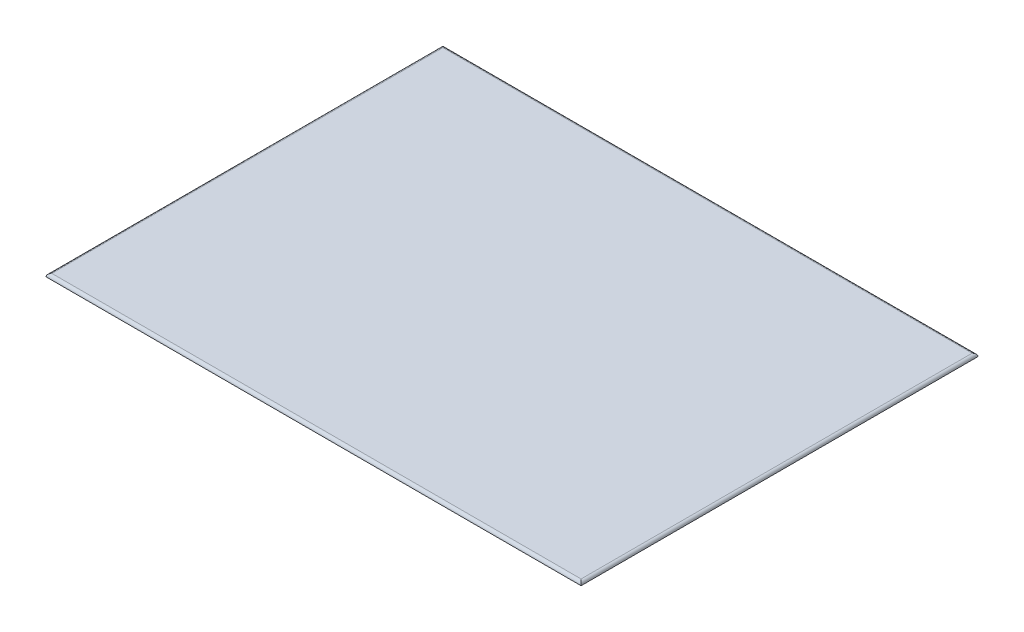
ISO-10303-21;
HEADER;
FILE_DESCRIPTION(('STEP AP214'),'2;1');
FILE_NAME('part.step','',(''),(''),'','','');
FILE_SCHEMA(('AUTOMOTIVE_DESIGN { 1 0 10303 214 1 1 1 1 }'));
ENDSEC;
DATA;
#1=APPLICATION_CONTEXT('core data for automotive mechanical design processes');
#2=APPLICATION_PROTOCOL_DEFINITION('international standard','automotive_design',2000,#1);
#3=PRODUCT_CONTEXT('',#1,'mechanical');
#4=PRODUCT('Part','Part','',(#3));
#5=PRODUCT_RELATED_PRODUCT_CATEGORY('part','',(#4));
#6=PRODUCT_DEFINITION_FORMATION('','',#4);
#7=PRODUCT_DEFINITION_CONTEXT('part definition',#1,'design');
#8=PRODUCT_DEFINITION('design','',#6,#7);
#9=PRODUCT_DEFINITION_SHAPE('','',#8);
#10=(LENGTH_UNIT() NAMED_UNIT(*) SI_UNIT(.MILLI.,.METRE.));
#11=(NAMED_UNIT(*) PLANE_ANGLE_UNIT() SI_UNIT($,.RADIAN.));
#12=(NAMED_UNIT(*) SI_UNIT($,.STERADIAN.) SOLID_ANGLE_UNIT());
#13=UNCERTAINTY_MEASURE_WITH_UNIT(LENGTH_MEASURE(1.E-05),#10,'distance_accuracy_value','');
#14=(GEOMETRIC_REPRESENTATION_CONTEXT(3) GLOBAL_UNCERTAINTY_ASSIGNED_CONTEXT((#13)) GLOBAL_UNIT_ASSIGNED_CONTEXT((#10,
#11,#12)) REPRESENTATION_CONTEXT('',''));
#15=CARTESIAN_POINT('',(0.,0.,0.));
#16=DIRECTION('',(0.,0.,1.));
#17=DIRECTION('',(1.,0.,0.));
#18=AXIS2_PLACEMENT_3D('',#15,#16,#17);
#19=CARTESIAN_POINT('',(0.,9.,0.));
#20=DIRECTION('',(0.,-1.,0.));
#21=DIRECTION('',(0.,0.,-1.));
#22=AXIS2_PLACEMENT_3D('',#19,#20,#21);
#23=PLANE('',#22);
#24=DIRECTION('',(0.,0.,1.));
#25=VECTOR('',#24,1.);
#26=CARTESIAN_POINT('',(-90.,9.,0.));
#27=LINE('',#26,#25);
#28=CARTESIAN_POINT('',(-90.,9.,-66.5));
#29=VERTEX_POINT('',#28);
#30=CARTESIAN_POINT('',(-90.,9.,66.5));
#31=VERTEX_POINT('',#30);
#32=EDGE_CURVE('E117',#29,#31,#27,.T.);
#33=ORIENTED_EDGE('',*,*,#32,.T.);
#34=DIRECTION('',(1.,0.,0.));
#35=VECTOR('',#34,1.);
#36=CARTESIAN_POINT('',(0.,9.,66.5));
#37=LINE('',#36,#35);
#38=CARTESIAN_POINT('',(90.,9.,66.5));
#39=VERTEX_POINT('',#38);
#40=EDGE_CURVE('E97',#31,#39,#37,.T.);
#41=ORIENTED_EDGE('',*,*,#40,.T.);
#42=DIRECTION('',(0.,0.,-1.));
#43=VECTOR('',#42,1.);
#44=CARTESIAN_POINT('',(90.,9.,0.));
#45=LINE('',#44,#43);
#46=CARTESIAN_POINT('',(90.,9.,-66.5));
#47=VERTEX_POINT('',#46);
#48=EDGE_CURVE('E107',#39,#47,#45,.T.);
#49=ORIENTED_EDGE('',*,*,#48,.T.);
#50=DIRECTION('',(-1.,0.,0.));
#51=VECTOR('',#50,1.);
#52=CARTESIAN_POINT('',(0.,9.,-66.5));
#53=LINE('',#52,#51);
#54=EDGE_CURVE('E113',#47,#29,#53,.T.);
#55=ORIENTED_EDGE('',*,*,#54,.T.);
#56=EDGE_LOOP('',(#33,#41,#49,#55));
#57=FACE_BOUND('',#56,.T.);
#58=ADVANCED_FACE('F39',(#57),#23,.F.);
#59=CARTESIAN_POINT('',(0.,0.,0.));
#60=DIRECTION('',(0.,-1.,0.));
#61=DIRECTION('',(0.,0.,-1.));
#62=AXIS2_PLACEMENT_3D('',#59,#60,#61);
#63=PLANE('',#62);
#64=DIRECTION('',(0.,0.,-1.));
#65=VECTOR('',#64,1.);
#66=CARTESIAN_POINT('',(-62.4342862858286,0.,-67.5));
#67=LINE('',#66,#65);
#68=CARTESIAN_POINT('',(-62.4342862858286,0.,38.9342862858286));
#69=VERTEX_POINT('',#68);
#70=CARTESIAN_POINT('',(-62.4342862858286,0.,-38.9342862858286));
#71=VERTEX_POINT('',#70);
#72=EDGE_CURVE('E49',#69,#71,#67,.T.);
#73=ORIENTED_EDGE('',*,*,#72,.T.);
#74=DIRECTION('',(1.,0.,0.));
#75=VECTOR('',#74,1.);
#76=CARTESIAN_POINT('',(91.,0.,-38.9342862858286));
#77=LINE('',#76,#75);
#78=CARTESIAN_POINT('',(62.4342862858286,0.,-38.9342862858286));
#79=VERTEX_POINT('',#78);
#80=EDGE_CURVE('E11',#71,#79,#77,.T.);
#81=ORIENTED_EDGE('',*,*,#80,.T.);
#82=DIRECTION('',(0.,0.,1.));
#83=VECTOR('',#82,1.);
#84=CARTESIAN_POINT('',(62.4342862858286,0.,67.5));
#85=LINE('',#84,#83);
#86=CARTESIAN_POINT('',(62.4342862858286,0.,38.9342862858286));
#87=VERTEX_POINT('',#86);
#88=EDGE_CURVE('E138',#79,#87,#85,.T.);
#89=ORIENTED_EDGE('',*,*,#88,.T.);
#90=DIRECTION('',(-1.,0.,0.));
#91=VECTOR('',#90,1.);
#92=CARTESIAN_POINT('',(-91.,0.,38.9342862858286));
#93=LINE('',#92,#91);
#94=EDGE_CURVE('E60',#87,#69,#93,.T.);
#95=ORIENTED_EDGE('',*,*,#94,.T.);
#96=EDGE_LOOP('',(#73,#81,#89,#95));
#97=FACE_BOUND('',#96,.T.);
#98=ADVANCED_FACE('F175',(#97),#63,.T.);
#99=CARTESIAN_POINT('',(0.,8.,-66.5));
#100=DIRECTION('',(-1.,0.,0.));
#101=DIRECTION('',(0.,0.,1.));
#102=AXIS2_PLACEMENT_3D('',#99,#100,#101);
#103=CYLINDRICAL_SURFACE('',#102,1.);
#104=CARTESIAN_POINT('',(90.,8.,-66.5));
#105=DIRECTION('',(-0.707106781186547,0.,-0.707106781186547));
#106=DIRECTION('',(0.707106781186547,0.,-0.707106781186547));
#107=AXIS2_PLACEMENT_3D('',#104,#105,#106);
#108=ELLIPSE('',#107,1.41421356237309,1.);
#109=CARTESIAN_POINT('',(91.,8.,-67.5));
#110=VERTEX_POINT('',#109);
#111=EDGE_CURVE('E109',#110,#47,#108,.F.);
#112=ORIENTED_EDGE('',*,*,#111,.F.);
#113=DIRECTION('',(-1.,0.,0.));
#114=VECTOR('',#113,1.);
#115=CARTESIAN_POINT('',(-91.,8.,-67.5));
#116=LINE('',#115,#114);
#117=CARTESIAN_POINT('',(-91.,8.,-67.5));
#118=VERTEX_POINT('',#117);
#119=EDGE_CURVE('E131',#118,#110,#116,.F.);
#120=ORIENTED_EDGE('',*,*,#119,.F.);
#121=CARTESIAN_POINT('',(-90.,8.,-66.5));
#122=DIRECTION('',(-0.707106781186547,0.,0.707106781186547));
#123=DIRECTION('',(-0.707106781186547,0.,-0.707106781186547));
#124=AXIS2_PLACEMENT_3D('',#121,#122,#123);
#125=ELLIPSE('',#124,1.41421356237309,1.);
#126=EDGE_CURVE('E114',#29,#118,#125,.T.);
#127=ORIENTED_EDGE('',*,*,#126,.F.);
#128=ORIENTED_EDGE('',*,*,#54,.F.);
#129=EDGE_LOOP('',(#112,#120,#127,#128));
#130=FACE_BOUND('',#129,.T.);
#131=ADVANCED_FACE('F177',(#130),#103,.T.);
#132=CARTESIAN_POINT('',(-90.,8.,0.));
#133=DIRECTION('',(0.,0.,1.));
#134=DIRECTION('',(1.,0.,0.));
#135=AXIS2_PLACEMENT_3D('',#132,#133,#134);
#136=CYLINDRICAL_SURFACE('',#135,1.);
#137=ORIENTED_EDGE('',*,*,#126,.T.);
#138=DIRECTION('',(0.,0.,1.));
#139=VECTOR('',#138,1.);
#140=CARTESIAN_POINT('',(-91.,8.,67.5));
#141=LINE('',#140,#139);
#142=CARTESIAN_POINT('',(-91.,8.,67.5));
#143=VERTEX_POINT('',#142);
#144=EDGE_CURVE('E123',#143,#118,#141,.F.);
#145=ORIENTED_EDGE('',*,*,#144,.F.);
#146=CARTESIAN_POINT('',(-90.,8.,66.5));
#147=DIRECTION('',(0.707106781186547,0.,0.707106781186547));
#148=DIRECTION('',(-0.707106781186547,0.,0.707106781186547));
#149=AXIS2_PLACEMENT_3D('',#146,#147,#148);
#150=ELLIPSE('',#149,1.41421356237309,1.);
#151=EDGE_CURVE('E104',#31,#143,#150,.T.);
#152=ORIENTED_EDGE('',*,*,#151,.F.);
#153=ORIENTED_EDGE('',*,*,#32,.F.);
#154=EDGE_LOOP('',(#137,#145,#152,#153));
#155=FACE_BOUND('',#154,.T.);
#156=ADVANCED_FACE('F183',(#155),#136,.T.);
#157=CARTESIAN_POINT('',(90.,8.,0.));
#158=DIRECTION('',(0.,0.,-1.));
#159=DIRECTION('',(-1.,0.,0.));
#160=AXIS2_PLACEMENT_3D('',#157,#158,#159);
#161=CYLINDRICAL_SURFACE('',#160,1.);
#162=ORIENTED_EDGE('',*,*,#111,.T.);
#163=ORIENTED_EDGE('',*,*,#48,.F.);
#164=CARTESIAN_POINT('',(90.,8.,66.5));
#165=DIRECTION('',(0.707106781186547,0.,-0.707106781186547));
#166=DIRECTION('',(-0.707106781186547,0.,-0.707106781186547));
#167=AXIS2_PLACEMENT_3D('',#164,#165,#166);
#168=ELLIPSE('',#167,1.41421356237309,1.);
#169=CARTESIAN_POINT('',(91.,8.,67.5));
#170=VERTEX_POINT('',#169);
#171=EDGE_CURVE('E93',#170,#39,#168,.F.);
#172=ORIENTED_EDGE('',*,*,#171,.F.);
#173=DIRECTION('',(0.,0.,-1.));
#174=VECTOR('',#173,1.);
#175=CARTESIAN_POINT('',(91.,8.,67.5));
#176=LINE('',#175,#174);
#177=EDGE_CURVE('E135',#110,#170,#176,.F.);
#178=ORIENTED_EDGE('',*,*,#177,.F.);
#179=EDGE_LOOP('',(#162,#163,#172,#178));
#180=FACE_BOUND('',#179,.T.);
#181=ADVANCED_FACE('F108',(#180),#161,.T.);
#182=CARTESIAN_POINT('',(0.,8.,66.5));
#183=DIRECTION('',(1.,0.,0.));
#184=DIRECTION('',(0.,0.,-1.));
#185=AXIS2_PLACEMENT_3D('',#182,#183,#184);
#186=CYLINDRICAL_SURFACE('',#185,1.);
#187=ORIENTED_EDGE('',*,*,#151,.T.);
#188=DIRECTION('',(1.,0.,0.));
#189=VECTOR('',#188,1.);
#190=CARTESIAN_POINT('',(-91.,8.,67.5));
#191=LINE('',#190,#189);
#192=EDGE_CURVE('E99',#170,#143,#191,.F.);
#193=ORIENTED_EDGE('',*,*,#192,.F.);
#194=ORIENTED_EDGE('',*,*,#171,.T.);
#195=ORIENTED_EDGE('',*,*,#40,.F.);
#196=EDGE_LOOP('',(#187,#193,#194,#195));
#197=FACE_BOUND('',#196,.T.);
#198=ADVANCED_FACE('F95',(#197),#186,.T.);
#199=CARTESIAN_POINT('',(-91.,55.,38.9342862858286));
#200=DIRECTION('',(1.,0.,0.));
#201=DIRECTION('',(0.,0.,-1.));
#202=AXIS2_PLACEMENT_3D('',#199,#200,#201);
#203=CYLINDRICAL_SURFACE('',#202,55.);
#204=CARTESIAN_POINT('',(-62.4342862858286,55.,38.9342862858286));
#205=DIRECTION('',(0.707106781186547,0.,0.707106781186547));
#206=DIRECTION('',(0.707106781186547,0.,-0.707106781186547));
#207=AXIS2_PLACEMENT_3D('',#204,#205,#206);
#208=ELLIPSE('',#207,77.7817459305202,55.);
#209=EDGE_CURVE('E158',#69,#143,#208,.F.);
#210=ORIENTED_EDGE('',*,*,#209,.F.);
#211=ORIENTED_EDGE('',*,*,#94,.F.);
#212=CARTESIAN_POINT('',(62.4342862858286,55.,38.9342862858286));
#213=DIRECTION('',(0.707106781186547,0.,-0.707106781186547));
#214=DIRECTION('',(-0.707106781186547,0.,-0.707106781186547));
#215=AXIS2_PLACEMENT_3D('',#212,#213,#214);
#216=ELLIPSE('',#215,77.7817459305202,55.);
#217=EDGE_CURVE('E43',#170,#87,#216,.T.);
#218=ORIENTED_EDGE('',*,*,#217,.F.);
#219=ORIENTED_EDGE('',*,*,#192,.T.);
#220=EDGE_LOOP('',(#210,#211,#218,#219));
#221=FACE_BOUND('',#220,.T.);
#222=ADVANCED_FACE('F41',(#221),#203,.T.);
#223=CARTESIAN_POINT('',(62.4342862858286,55.,67.5));
#224=DIRECTION('',(0.,0.,-1.));
#225=DIRECTION('',(-1.,0.,0.));
#226=AXIS2_PLACEMENT_3D('',#223,#224,#225);
#227=CYLINDRICAL_SURFACE('',#226,55.);
#228=ORIENTED_EDGE('',*,*,#217,.T.);
#229=ORIENTED_EDGE('',*,*,#88,.F.);
#230=CARTESIAN_POINT('',(62.4342862858286,55.,-38.9342862858286));
#231=DIRECTION('',(-0.707106781186547,0.,-0.707106781186547));
#232=DIRECTION('',(0.707106781186547,0.,-0.707106781186547));
#233=AXIS2_PLACEMENT_3D('',#230,#231,#232);
#234=ELLIPSE('',#233,77.7817459305202,55.);
#235=EDGE_CURVE('E156',#110,#79,#234,.T.);
#236=ORIENTED_EDGE('',*,*,#235,.F.);
#237=ORIENTED_EDGE('',*,*,#177,.T.);
#238=EDGE_LOOP('',(#228,#229,#236,#237));
#239=FACE_BOUND('',#238,.T.);
#240=ADVANCED_FACE('F166',(#239),#227,.T.);
#241=CARTESIAN_POINT('',(-62.4342862858286,55.,67.5));
#242=DIRECTION('',(0.,0.,1.));
#243=DIRECTION('',(1.,0.,0.));
#244=AXIS2_PLACEMENT_3D('',#241,#242,#243);
#245=CYLINDRICAL_SURFACE('',#244,55.);
#246=ORIENTED_EDGE('',*,*,#209,.T.);
#247=ORIENTED_EDGE('',*,*,#144,.T.);
#248=CARTESIAN_POINT('',(-62.4342862858286,55.,-38.9342862858286));
#249=DIRECTION('',(-0.707106781186547,0.,0.707106781186547));
#250=DIRECTION('',(0.707106781186547,0.,0.707106781186547));
#251=AXIS2_PLACEMENT_3D('',#248,#249,#250);
#252=ELLIPSE('',#251,77.7817459305202,55.);
#253=EDGE_CURVE('E153',#71,#118,#252,.F.);
#254=ORIENTED_EDGE('',*,*,#253,.F.);
#255=ORIENTED_EDGE('',*,*,#72,.F.);
#256=EDGE_LOOP('',(#246,#247,#254,#255));
#257=FACE_BOUND('',#256,.T.);
#258=ADVANCED_FACE('F170',(#257),#245,.T.);
#259=CARTESIAN_POINT('',(-91.,55.,-38.9342862858286));
#260=DIRECTION('',(-1.,0.,0.));
#261=DIRECTION('',(0.,0.,1.));
#262=AXIS2_PLACEMENT_3D('',#259,#260,#261);
#263=CYLINDRICAL_SURFACE('',#262,55.);
#264=ORIENTED_EDGE('',*,*,#235,.T.);
#265=ORIENTED_EDGE('',*,*,#80,.F.);
#266=ORIENTED_EDGE('',*,*,#253,.T.);
#267=ORIENTED_EDGE('',*,*,#119,.T.);
#268=EDGE_LOOP('',(#264,#265,#266,#267));
#269=FACE_BOUND('',#268,.T.);
#270=ADVANCED_FACE('F174',(#269),#263,.T.);
#271=CLOSED_SHELL('',(#58,#98,#131,#156,#181,#198,#222,#240,#258,#270));
#272=MANIFOLD_SOLID_BREP('B2',#271);
#273=ADVANCED_BREP_SHAPE_REPRESENTATION('',(#18,#272),#14);
#274=SHAPE_DEFINITION_REPRESENTATION(#9,#273);
ENDSEC;
END-ISO-10303-21;
